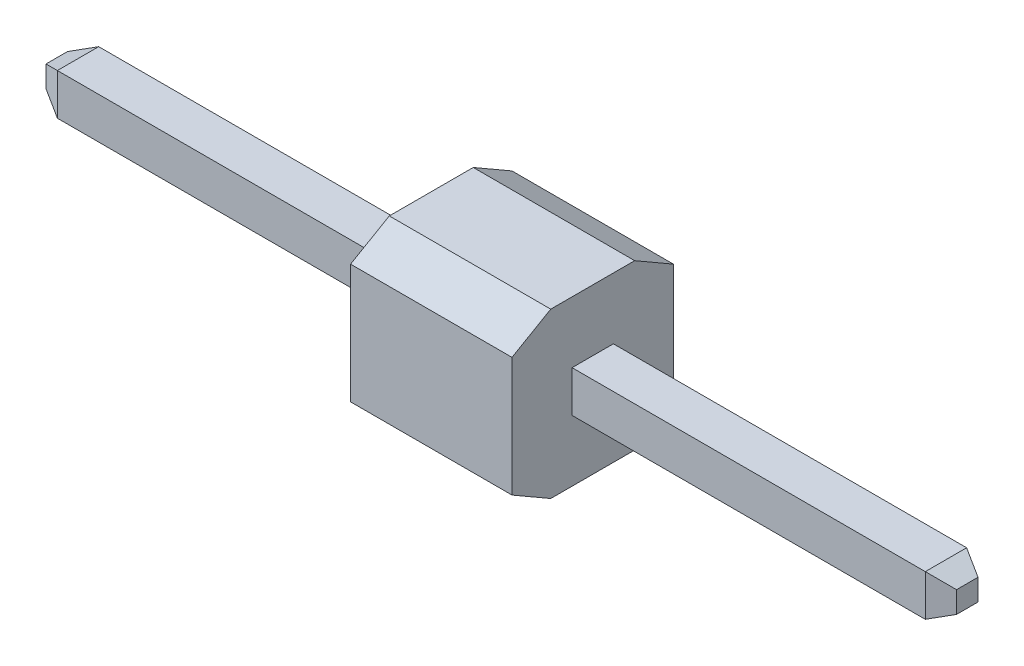
ISO-10303-21;
HEADER;
FILE_DESCRIPTION(('STEP AP214'),'2;1');
FILE_NAME('part.step','',(''),(''),'','','');
FILE_SCHEMA(('AUTOMOTIVE_DESIGN { 1 0 10303 214 1 1 1 1 }'));
ENDSEC;
DATA;
#1=APPLICATION_CONTEXT('core data for automotive mechanical design processes');
#2=APPLICATION_PROTOCOL_DEFINITION('international standard','automotive_design',2000,#1);
#3=PRODUCT_CONTEXT('',#1,'mechanical');
#4=PRODUCT('Part','Part','',(#3));
#5=PRODUCT_RELATED_PRODUCT_CATEGORY('part','',(#4));
#6=PRODUCT_DEFINITION_FORMATION('','',#4);
#7=PRODUCT_DEFINITION_CONTEXT('part definition',#1,'design');
#8=PRODUCT_DEFINITION('design','',#6,#7);
#9=PRODUCT_DEFINITION_SHAPE('','',#8);
#10=(LENGTH_UNIT() NAMED_UNIT(*) SI_UNIT(.MILLI.,.METRE.));
#11=(NAMED_UNIT(*) PLANE_ANGLE_UNIT() SI_UNIT($,.RADIAN.));
#12=(NAMED_UNIT(*) SI_UNIT($,.STERADIAN.) SOLID_ANGLE_UNIT());
#13=UNCERTAINTY_MEASURE_WITH_UNIT(LENGTH_MEASURE(1.E-05),#10,'distance_accuracy_value','');
#14=(GEOMETRIC_REPRESENTATION_CONTEXT(3) GLOBAL_UNCERTAINTY_ASSIGNED_CONTEXT((#13)) GLOBAL_UNIT_ASSIGNED_CONTEXT((#10,
#11,#12)) REPRESENTATION_CONTEXT('',''));
#15=CARTESIAN_POINT('',(0.,0.,0.));
#16=DIRECTION('',(0.,0.,1.));
#17=DIRECTION('',(1.,0.,0.));
#18=AXIS2_PLACEMENT_3D('',#15,#16,#17);
#19=CARTESIAN_POINT('',(5.4210745014383,9.8428784128063,0.629998634255617));
#20=DIRECTION('',(1.,4.37113882867379E-08,-4.37113882867379E-08));
#21=DIRECTION('',(-4.37113882867379E-08,1.,0.));
#22=AXIS2_PLACEMENT_3D('',#19,#20,#21);
#23=PLANE('',#22);
#24=DIRECTION('',(1.59994790123753E-08,0.500000000000192,0.866025403784328));
#25=VECTOR('',#24,1.);
#26=CARTESIAN_POINT('',(5.42107437845239,11.0864682512923,-0.940001365744382));
#27=LINE('',#26,#25);
#28=CARTESIAN_POINT('',(5.42107437845239,11.0864682512923,-0.940001365744382));
#29=VERTEX_POINT('',#28);
#30=CARTESIAN_POINT('',(5.42107438953715,11.4328784128063,-0.340001365744383));
#31=VERTEX_POINT('',#30);
#32=EDGE_CURVE('E11',#29,#31,#27,.T.);
#33=ORIENTED_EDGE('',*,*,#32,.T.);
#34=DIRECTION('',(4.37113886966664E-08,0.,0.999999999999999));
#35=VECTOR('',#34,1.);
#36=CARTESIAN_POINT('',(5.42107438953715,11.4328784128063,-0.340001365744383));
#37=LINE('',#36,#35);
#38=CARTESIAN_POINT('',(5.42107444636195,11.4328784128063,0.959998634255618));
#39=VERTEX_POINT('',#38);
#40=EDGE_CURVE('E304',#31,#39,#37,.T.);
#41=ORIENTED_EDGE('',*,*,#40,.T.);
#42=DIRECTION('',(5.97108656004285E-08,-0.500000000000188,0.866025403784328));
#43=VECTOR('',#42,1.);
#44=CARTESIAN_POINT('',(5.42107444636195,11.4328784128063,0.959998634255618));
#45=LINE('',#44,#43);
#46=CARTESIAN_POINT('',(5.42107448773086,11.0864682512923,1.55999863425562));
#47=VERTEX_POINT('',#46);
#48=EDGE_CURVE('E296',#39,#47,#45,.T.);
#49=ORIENTED_EDGE('',*,*,#48,.T.);
#50=DIRECTION('',(4.37113884815072E-08,-0.999999999999999,0.));
#51=VECTOR('',#50,1.);
#52=CARTESIAN_POINT('',(5.42107448773086,11.0864682512923,1.55999863425562));
#53=LINE('',#52,#51);
#54=CARTESIAN_POINT('',(5.42107456847364,9.2392885743203,1.55999863425562));
#55=VERTEX_POINT('',#54);
#56=EDGE_CURVE('E281',#47,#55,#53,.T.);
#57=ORIENTED_EDGE('',*,*,#56,.T.);
#58=DIRECTION('',(1.59994777304001E-08,0.500000000000192,0.866025403784328));
#59=VECTOR('',#58,1.);
#60=CARTESIAN_POINT('',(5.42107455738888,8.8928784128063,0.959998634255618));
#61=LINE('',#60,#59);
#62=CARTESIAN_POINT('',(5.42107455738888,8.8928784128063,0.959998634255618));
#63=VERTEX_POINT('',#62);
#64=EDGE_CURVE('E265',#63,#55,#61,.T.);
#65=ORIENTED_EDGE('',*,*,#64,.F.);
#66=DIRECTION('',(4.37113886966664E-08,0.,0.999999999999999));
#67=VECTOR('',#66,1.);
#68=CARTESIAN_POINT('',(5.42107450056408,8.8928784128063,-0.340001365744383));
#69=LINE('',#68,#67);
#70=CARTESIAN_POINT('',(5.42107450056408,8.8928784128063,-0.340001365744383));
#71=VERTEX_POINT('',#70);
#72=EDGE_CURVE('E248',#71,#63,#69,.T.);
#73=ORIENTED_EDGE('',*,*,#72,.F.);
#74=DIRECTION('',(5.97108668824036E-08,-0.500000000000188,0.866025403784328));
#75=VECTOR('',#74,1.);
#76=CARTESIAN_POINT('',(5.42107445919517,9.2392885743203,-0.940001365744382));
#77=LINE('',#76,#75);
#78=CARTESIAN_POINT('',(5.42107445919517,9.2392885743203,-0.940001365744382));
#79=VERTEX_POINT('',#78);
#80=EDGE_CURVE('E242',#79,#71,#77,.T.);
#81=ORIENTED_EDGE('',*,*,#80,.F.);
#82=DIRECTION('',(4.37113884815072E-08,-0.999999999999999,0.));
#83=VECTOR('',#82,1.);
#84=CARTESIAN_POINT('',(5.42107437845239,11.0864682512923,-0.940001365744382));
#85=LINE('',#84,#83);
#86=EDGE_CURVE('E236',#29,#79,#85,.T.);
#87=ORIENTED_EDGE('',*,*,#86,.F.);
#88=EDGE_LOOP('',(#33,#41,#49,#57,#65,#73,#81,#87));
#89=FACE_BOUND('',#88,.T.);
#90=DIRECTION('',(-4.37113886753159E-08,0.,-0.999999999999999));
#91=VECTOR('',#90,1.);
#92=CARTESIAN_POINT('',(5.42107447346302,10.4828784128063,0.629998634255617));
#93=LINE('',#92,#91);
#94=CARTESIAN_POINT('',(5.42107447346302,10.4828784128063,0.629998634255617));
#95=VERTEX_POINT('',#94);
#96=CARTESIAN_POINT('',(5.42107444548773,10.4828784128063,-0.0100013657443826));
#97=VERTEX_POINT('',#96);
#98=EDGE_CURVE('E302',#95,#97,#93,.T.);
#99=ORIENTED_EDGE('',*,*,#98,.T.);
#100=DIRECTION('',(-4.3711388675316E-08,0.999999999999999,0.));
#101=VECTOR('',#100,1.);
#102=CARTESIAN_POINT('',(5.42107447346302,9.8428784128063,-0.0100013657443826));
#103=LINE('',#102,#101);
#104=CARTESIAN_POINT('',(5.42107447346302,9.8428784128063,-0.0100013657443826));
#105=VERTEX_POINT('',#104);
#106=EDGE_CURVE('E293',#105,#97,#103,.T.);
#107=ORIENTED_EDGE('',*,*,#106,.F.);
#108=DIRECTION('',(-4.37113886753159E-08,0.,-0.999999999999999));
#109=VECTOR('',#108,1.);
#110=CARTESIAN_POINT('',(5.4210745014383,9.8428784128063,0.629998634255617));
#111=LINE('',#110,#109);
#112=CARTESIAN_POINT('',(5.4210745014383,9.8428784128063,0.629998634255617));
#113=VERTEX_POINT('',#112);
#114=EDGE_CURVE('E278',#113,#105,#111,.T.);
#115=ORIENTED_EDGE('',*,*,#114,.F.);
#116=DIRECTION('',(-4.3711388675316E-08,0.999999999999999,0.));
#117=VECTOR('',#116,1.);
#118=CARTESIAN_POINT('',(5.4210745014383,9.8428784128063,0.629998634255617));
#119=LINE('',#118,#117);
#120=EDGE_CURVE('E263',#113,#95,#119,.T.);
#121=ORIENTED_EDGE('',*,*,#120,.T.);
#122=EDGE_LOOP('',(#99,#107,#115,#121));
#123=FACE_BOUND('',#122,.T.);
#124=ADVANCED_FACE('F17',(#89,#123),#23,.T.);
#125=CARTESIAN_POINT('',(2.9210745014383,9.84287830352783,0.629998743534088));
#126=DIRECTION('',(1.,4.37113882867379E-08,-4.37113882867379E-08));
#127=DIRECTION('',(-4.37113882867379E-08,1.,0.));
#128=AXIS2_PLACEMENT_3D('',#125,#126,#127);
#129=PLANE('',#128);
#130=DIRECTION('',(1.59994783713877E-08,0.500000000000192,0.866025403784328));
#131=VECTOR('',#130,1.);
#132=CARTESIAN_POINT('',(2.92107437845239,11.0864681420138,-0.940001256465912));
#133=LINE('',#132,#131);
#134=CARTESIAN_POINT('',(2.92107437845239,11.0864681420138,-0.940001256465912));
#135=VERTEX_POINT('',#134);
#136=CARTESIAN_POINT('',(2.92107438953715,11.4328783035278,-0.340001256465912));
#137=VERTEX_POINT('',#136);
#138=EDGE_CURVE('E24',#135,#137,#133,.T.);
#139=ORIENTED_EDGE('',*,*,#138,.F.);
#140=DIRECTION('',(4.37113882410924E-08,-0.999999999999999,0.));
#141=VECTOR('',#140,1.);
#142=CARTESIAN_POINT('',(2.92107437845239,11.0864681420138,-0.940001256465912));
#143=LINE('',#142,#141);
#144=CARTESIAN_POINT('',(2.92107445919517,9.23928846504183,-0.940001256465912));
#145=VERTEX_POINT('',#144);
#146=EDGE_CURVE('E300',#135,#145,#143,.T.);
#147=ORIENTED_EDGE('',*,*,#146,.T.);
#148=DIRECTION('',(5.97108668824036E-08,-0.500000000000188,0.866025403784328));
#149=VECTOR('',#148,1.);
#150=CARTESIAN_POINT('',(2.92107445919517,9.23928846504183,-0.940001256465912));
#151=LINE('',#150,#149);
#152=CARTESIAN_POINT('',(2.92107450056408,8.89287830352783,-0.340001256465912));
#153=VERTEX_POINT('',#152);
#154=EDGE_CURVE('E286',#145,#153,#151,.T.);
#155=ORIENTED_EDGE('',*,*,#154,.T.);
#156=DIRECTION('',(4.37113883550593E-08,0.,0.999999999999999));
#157=VECTOR('',#156,1.);
#158=CARTESIAN_POINT('',(2.92107450056408,8.89287830352783,-0.340001256465912));
#159=LINE('',#158,#157);
#160=CARTESIAN_POINT('',(2.92107455738888,8.89287830352783,0.959998743534088));
#161=VERTEX_POINT('',#160);
#162=EDGE_CURVE('E271',#153,#161,#159,.T.);
#163=ORIENTED_EDGE('',*,*,#162,.T.);
#164=DIRECTION('',(1.59994783713877E-08,0.500000000000192,0.866025403784328));
#165=VECTOR('',#164,1.);
#166=CARTESIAN_POINT('',(2.92107455738888,8.89287830352783,0.959998743534088));
#167=LINE('',#166,#165);
#168=CARTESIAN_POINT('',(2.92107456847364,9.23928846504183,1.55999874353409));
#169=VERTEX_POINT('',#168);
#170=EDGE_CURVE('E253',#161,#169,#167,.T.);
#171=ORIENTED_EDGE('',*,*,#170,.T.);
#172=DIRECTION('',(4.37113882410924E-08,-0.999999999999999,0.));
#173=VECTOR('',#172,1.);
#174=CARTESIAN_POINT('',(2.92107448773086,11.0864681420138,1.55999874353409));
#175=LINE('',#174,#173);
#176=CARTESIAN_POINT('',(2.92107448773086,11.0864681420138,1.55999874353409));
#177=VERTEX_POINT('',#176);
#178=EDGE_CURVE('E261',#177,#169,#175,.T.);
#179=ORIENTED_EDGE('',*,*,#178,.F.);
#180=DIRECTION('',(5.97108668824036E-08,-0.500000000000188,0.866025403784328));
#181=VECTOR('',#180,1.);
#182=CARTESIAN_POINT('',(2.92107444636195,11.4328783035278,0.959998743534088));
#183=LINE('',#182,#181);
#184=CARTESIAN_POINT('',(2.92107444636195,11.4328783035278,0.959998743534088));
#185=VERTEX_POINT('',#184);
#186=EDGE_CURVE('E276',#185,#177,#183,.T.);
#187=ORIENTED_EDGE('',*,*,#186,.F.);
#188=DIRECTION('',(4.37113883550593E-08,0.,0.999999999999999));
#189=VECTOR('',#188,1.);
#190=CARTESIAN_POINT('',(2.92107438953715,11.4328783035278,-0.340001256465912));
#191=LINE('',#190,#189);
#192=EDGE_CURVE('E291',#137,#185,#191,.T.);
#193=ORIENTED_EDGE('',*,*,#192,.F.);
#194=EDGE_LOOP('',(#139,#147,#155,#163,#171,#179,#187,#193));
#195=FACE_BOUND('',#194,.T.);
#196=DIRECTION('',(-4.37113879814266E-08,0.999999999999999,0.));
#197=VECTOR('',#196,1.);
#198=CARTESIAN_POINT('',(2.92107447346301,9.84287830352783,-0.0100012564659119));
#199=LINE('',#198,#197);
#200=CARTESIAN_POINT('',(2.92107447346301,9.84287830352783,-0.0100012564659119));
#201=VERTEX_POINT('',#200);
#202=CARTESIAN_POINT('',(2.92107444548773,10.4828783035278,-0.0100012564659119));
#203=VERTEX_POINT('',#202);
#204=EDGE_CURVE('E298',#201,#203,#199,.T.);
#205=ORIENTED_EDGE('',*,*,#204,.T.);
#206=DIRECTION('',(-4.37113879814266E-08,0.,-0.999999999999999));
#207=VECTOR('',#206,1.);
#208=CARTESIAN_POINT('',(2.92107447346301,10.4828783035278,0.629998743534088));
#209=LINE('',#208,#207);
#210=CARTESIAN_POINT('',(2.92107447346301,10.4828783035278,0.629998743534088));
#211=VERTEX_POINT('',#210);
#212=EDGE_CURVE('E283',#211,#203,#209,.T.);
#213=ORIENTED_EDGE('',*,*,#212,.F.);
#214=DIRECTION('',(-4.3711388675316E-08,0.999999999999999,0.));
#215=VECTOR('',#214,1.);
#216=CARTESIAN_POINT('',(2.9210745014383,9.84287830352783,0.629998743534088));
#217=LINE('',#216,#215);
#218=CARTESIAN_POINT('',(2.9210745014383,9.84287830352783,0.629998743534088));
#219=VERTEX_POINT('',#218);
#220=EDGE_CURVE('E268',#219,#211,#217,.T.);
#221=ORIENTED_EDGE('',*,*,#220,.F.);
#222=DIRECTION('',(-4.37113886753159E-08,0.,-0.999999999999999));
#223=VECTOR('',#222,1.);
#224=CARTESIAN_POINT('',(2.9210745014383,9.84287830352783,0.629998743534088));
#225=LINE('',#224,#223);
#226=EDGE_CURVE('E251',#219,#201,#225,.T.);
#227=ORIENTED_EDGE('',*,*,#226,.T.);
#228=EDGE_LOOP('',(#205,#213,#221,#227));
#229=FACE_BOUND('',#228,.T.);
#230=ADVANCED_FACE('F314',(#195,#229),#129,.F.);
#231=CARTESIAN_POINT('',(5.42107437845239,11.0864682512923,-0.940001365744382));
#232=DIRECTION('',(5.97108668343731E-08,-0.866025403784328,0.50000000000019));
#233=DIRECTION('',(-1.59994785476185E-08,-0.500000000000192,-0.866025403784329));
#234=AXIS2_PLACEMENT_3D('',#231,#232,#233);
#235=PLANE('',#234);
#236=ORIENTED_EDGE('',*,*,#138,.T.);
#237=DIRECTION('',(-0.999999999999998,-4.37113889972806E-08,4.37113883755557E-08));
#238=VECTOR('',#237,1.);
#239=CARTESIAN_POINT('',(5.42107438953715,11.4328784128063,-0.340001365744383));
#240=LINE('',#239,#238);
#241=EDGE_CURVE('E288',#31,#137,#240,.T.);
#242=ORIENTED_EDGE('',*,*,#241,.F.);
#243=ORIENTED_EDGE('',*,*,#32,.F.);
#244=DIRECTION('',(-0.999999999999998,-4.37113882867378E-08,4.37113881091022E-08));
#245=VECTOR('',#244,1.);
#246=CARTESIAN_POINT('',(5.42107437845239,11.0864682512923,-0.940001365744382));
#247=LINE('',#246,#245);
#248=EDGE_CURVE('E256',#29,#135,#247,.T.);
#249=ORIENTED_EDGE('',*,*,#248,.T.);
#250=EDGE_LOOP('',(#236,#242,#243,#249));
#251=FACE_BOUND('',#250,.T.);
#252=ADVANCED_FACE('F306',(#251),#235,.F.);
#253=CARTESIAN_POINT('',(5.42107438953715,11.4328784128063,-0.340001365744383));
#254=DIRECTION('',(4.37113882867379E-08,-1.,0.));
#255=DIRECTION('',(1.,4.37113882867379E-08,-4.37113882867379E-08));
#256=AXIS2_PLACEMENT_3D('',#253,#254,#255);
#257=PLANE('',#256);
#258=ORIENTED_EDGE('',*,*,#192,.T.);
#259=DIRECTION('',(-0.999999999999998,-4.37113882867378E-08,4.37113882867378E-08));
#260=VECTOR('',#259,1.);
#261=CARTESIAN_POINT('',(5.42107444636195,11.4328784128063,0.959998634255618));
#262=LINE('',#261,#260);
#263=EDGE_CURVE('E273',#39,#185,#262,.T.);
#264=ORIENTED_EDGE('',*,*,#263,.F.);
#265=ORIENTED_EDGE('',*,*,#40,.F.);
#266=ORIENTED_EDGE('',*,*,#241,.T.);
#267=EDGE_LOOP('',(#258,#264,#265,#266));
#268=FACE_BOUND('',#267,.T.);
#269=ADVANCED_FACE('F311',(#268),#257,.F.);
#270=CARTESIAN_POINT('',(5.42107444636195,11.4328784128063,0.959998634255618));
#271=DIRECTION('',(1.59994785476185E-08,-0.86602540378433,-0.50000000000019));
#272=DIRECTION('',(-5.97108668343731E-08,0.500000000000188,-0.866025403784329));
#273=AXIS2_PLACEMENT_3D('',#270,#271,#272);
#274=PLANE('',#273);
#275=ORIENTED_EDGE('',*,*,#186,.T.);
#276=DIRECTION('',(-0.999999999999998,-4.37113882867378E-08,4.37113882867378E-08));
#277=VECTOR('',#276,1.);
#278=CARTESIAN_POINT('',(5.42107448773086,11.0864682512923,1.55999863425562));
#279=LINE('',#278,#277);
#280=EDGE_CURVE('E258',#47,#177,#279,.T.);
#281=ORIENTED_EDGE('',*,*,#280,.F.);
#282=ORIENTED_EDGE('',*,*,#48,.F.);
#283=ORIENTED_EDGE('',*,*,#263,.T.);
#284=EDGE_LOOP('',(#275,#281,#282,#283));
#285=FACE_BOUND('',#284,.T.);
#286=ADVANCED_FACE('F319',(#285),#274,.F.);
#287=CARTESIAN_POINT('',(5.42107448773086,11.0864682512923,1.55999863425562));
#288=DIRECTION('',(-4.37113882867379E-08,0.,-1.));
#289=DIRECTION('',(-1.,-4.37113882867379E-08,4.37113882867379E-08));
#290=AXIS2_PLACEMENT_3D('',#287,#288,#289);
#291=PLANE('',#290);
#292=ORIENTED_EDGE('',*,*,#178,.T.);
#293=DIRECTION('',(-0.999999999999998,-4.37113889972806E-08,4.37113882867378E-08));
#294=VECTOR('',#293,1.);
#295=CARTESIAN_POINT('',(5.42107456847364,9.2392885743203,1.55999863425562));
#296=LINE('',#295,#294);
#297=EDGE_CURVE('E245',#55,#169,#296,.T.);
#298=ORIENTED_EDGE('',*,*,#297,.F.);
#299=ORIENTED_EDGE('',*,*,#56,.F.);
#300=ORIENTED_EDGE('',*,*,#280,.T.);
#301=EDGE_LOOP('',(#292,#298,#299,#300));
#302=FACE_BOUND('',#301,.T.);
#303=ADVANCED_FACE('F326',(#302),#291,.F.);
#304=CARTESIAN_POINT('',(5.42107455738888,8.8928784128063,0.959998634255618));
#305=DIRECTION('',(5.97108668343731E-08,-0.866025403784328,0.50000000000019));
#306=DIRECTION('',(-1.59994785476185E-08,-0.500000000000192,-0.866025403784329));
#307=AXIS2_PLACEMENT_3D('',#304,#305,#306);
#308=PLANE('',#307);
#309=ORIENTED_EDGE('',*,*,#170,.F.);
#310=DIRECTION('',(-0.999999999999998,-4.37113882867378E-08,4.37113882867378E-08));
#311=VECTOR('',#310,1.);
#312=CARTESIAN_POINT('',(5.42107455738888,8.8928784128063,0.959998634255618));
#313=LINE('',#312,#311);
#314=EDGE_CURVE('E239',#63,#161,#313,.T.);
#315=ORIENTED_EDGE('',*,*,#314,.F.);
#316=ORIENTED_EDGE('',*,*,#64,.T.);
#317=ORIENTED_EDGE('',*,*,#297,.T.);
#318=EDGE_LOOP('',(#309,#315,#316,#317));
#319=FACE_BOUND('',#318,.T.);
#320=ADVANCED_FACE('F329',(#319),#308,.T.);
#321=CARTESIAN_POINT('',(5.42107450056408,8.8928784128063,-0.340001365744383));
#322=DIRECTION('',(4.37113882867379E-08,-1.,0.));
#323=DIRECTION('',(1.,4.37113882867379E-08,-4.37113882867379E-08));
#324=AXIS2_PLACEMENT_3D('',#321,#322,#323);
#325=PLANE('',#324);
#326=ORIENTED_EDGE('',*,*,#162,.F.);
#327=DIRECTION('',(-0.999999999999998,-4.37113882867378E-08,4.37113883755557E-08));
#328=VECTOR('',#327,1.);
#329=CARTESIAN_POINT('',(5.42107450056408,8.8928784128063,-0.340001365744383));
#330=LINE('',#329,#328);
#331=EDGE_CURVE('E233',#71,#153,#330,.T.);
#332=ORIENTED_EDGE('',*,*,#331,.F.);
#333=ORIENTED_EDGE('',*,*,#72,.T.);
#334=ORIENTED_EDGE('',*,*,#314,.T.);
#335=EDGE_LOOP('',(#326,#332,#333,#334));
#336=FACE_BOUND('',#335,.T.);
#337=ADVANCED_FACE('F333',(#336),#325,.T.);
#338=CARTESIAN_POINT('',(5.42107445919517,9.2392885743203,-0.940001365744382));
#339=DIRECTION('',(1.59994785476185E-08,-0.86602540378433,-0.50000000000019));
#340=DIRECTION('',(-5.97108668343731E-08,0.500000000000188,-0.866025403784329));
#341=AXIS2_PLACEMENT_3D('',#338,#339,#340);
#342=PLANE('',#341);
#343=ORIENTED_EDGE('',*,*,#154,.F.);
#344=DIRECTION('',(-0.999999999999998,-4.37113889972806E-08,4.37113881091022E-08));
#345=VECTOR('',#344,1.);
#346=CARTESIAN_POINT('',(5.42107445919517,9.2392885743203,-0.940001365744382));
#347=LINE('',#346,#345);
#348=EDGE_CURVE('E230',#79,#145,#347,.T.);
#349=ORIENTED_EDGE('',*,*,#348,.F.);
#350=ORIENTED_EDGE('',*,*,#80,.T.);
#351=ORIENTED_EDGE('',*,*,#331,.T.);
#352=EDGE_LOOP('',(#343,#349,#350,#351));
#353=FACE_BOUND('',#352,.T.);
#354=ADVANCED_FACE('F337',(#353),#342,.T.);
#355=CARTESIAN_POINT('',(5.42107437845239,11.0864682512923,-0.940001365744382));
#356=DIRECTION('',(-4.37113882867379E-08,0.,-1.));
#357=DIRECTION('',(-4.37113882867379E-08,1.,0.));
#358=AXIS2_PLACEMENT_3D('',#355,#356,#357);
#359=PLANE('',#358);
#360=ORIENTED_EDGE('',*,*,#146,.F.);
#361=ORIENTED_EDGE('',*,*,#248,.F.);
#362=ORIENTED_EDGE('',*,*,#86,.T.);
#363=ORIENTED_EDGE('',*,*,#348,.T.);
#364=EDGE_LOOP('',(#360,#361,#362,#363));
#365=FACE_BOUND('',#364,.T.);
#366=ADVANCED_FACE('F339',(#365),#359,.T.);
#367=CARTESIAN_POINT('',(-2.8789254985617,9.84287805000178,0.62999899706014));
#368=DIRECTION('',(-1.,-4.37113882867379E-08,4.37113882867379E-08));
#369=DIRECTION('',(4.37113882867379E-08,-1.,0.));
#370=AXIS2_PLACEMENT_3D('',#367,#368,#369);
#371=PLANE('',#370);
#372=DIRECTION('',(4.37113874013716E-08,-0.999999999999999,0.));
#373=VECTOR('',#372,1.);
#374=CARTESIAN_POINT('',(-2.87892554105952,10.3289965228108,0.14388052425114));
#375=LINE('',#374,#373);
#376=CARTESIAN_POINT('',(-2.87892554105952,10.3289965228108,0.14388052425114));
#377=VERTEX_POINT('',#376);
#378=CARTESIAN_POINT('',(-2.87892552653699,9.99675957719278,0.14388052425114));
#379=VERTEX_POINT('',#378);
#380=EDGE_CURVE('E228',#377,#379,#375,.T.);
#381=ORIENTED_EDGE('',*,*,#380,.T.);
#382=DIRECTION('',(4.37113900746999E-08,0.,0.999999999999999));
#383=VECTOR('',#382,1.);
#384=CARTESIAN_POINT('',(-2.87892552653699,9.99675957719278,0.14388052425114));
#385=LINE('',#384,#383);
#386=CARTESIAN_POINT('',(-2.87892551201445,9.99675957719278,0.47611746986914));
#387=VERTEX_POINT('',#386);
#388=EDGE_CURVE('E223',#379,#387,#385,.T.);
#389=ORIENTED_EDGE('',*,*,#388,.T.);
#390=DIRECTION('',(-4.37113900746999E-08,0.999999999999999,0.));
#391=VECTOR('',#390,1.);
#392=CARTESIAN_POINT('',(-2.87892551201445,9.99675957719278,0.47611746986914));
#393=LINE('',#392,#391);
#394=CARTESIAN_POINT('',(-2.87892552653699,10.3289965228108,0.47611746986914));
#395=VERTEX_POINT('',#394);
#396=EDGE_CURVE('E215',#387,#395,#393,.T.);
#397=ORIENTED_EDGE('',*,*,#396,.T.);
#398=DIRECTION('',(-4.37113820547151E-08,0.,-0.999999999999999));
#399=VECTOR('',#398,1.);
#400=CARTESIAN_POINT('',(-2.87892552653699,10.3289965228108,0.47611746986914));
#401=LINE('',#400,#399);
#402=EDGE_CURVE('E207',#395,#377,#401,.T.);
#403=ORIENTED_EDGE('',*,*,#402,.T.);
#404=EDGE_LOOP('',(#381,#389,#397,#403));
#405=FACE_BOUND('',#404,.T.);
#406=ADVANCED_FACE('F341',(#405),#371,.T.);
#407=CARTESIAN_POINT('',(-2.8789254985617,9.84287805000178,0.62999899706014));
#408=DIRECTION('',(4.37113882867379E-08,-1.,0.));
#409=DIRECTION('',(-4.37113882867379E-08,0.,-1.));
#410=AXIS2_PLACEMENT_3D('',#407,#408,#409);
#411=PLANE('',#410);
#412=DIRECTION('',(0.999999999999998,4.37113885205545E-08,-4.37113882769955E-08));
#413=VECTOR('',#412,1.);
#414=CARTESIAN_POINT('',(-2.5489254985617,9.84287806442654,0.629998982635382));
#415=LINE('',#414,#413);
#416=CARTESIAN_POINT('',(-2.5489254985617,9.84287806442654,0.629998982635382));
#417=VERTEX_POINT('',#416);
#418=EDGE_CURVE('E225',#417,#219,#415,.T.);
#419=ORIENTED_EDGE('',*,*,#418,.F.);
#420=DIRECTION('',(-4.37113886753159E-08,0.,-0.999999999999999));
#421=VECTOR('',#420,1.);
#422=CARTESIAN_POINT('',(-2.5489254985617,9.84287806442654,0.629998982635382));
#423=LINE('',#422,#421);
#424=CARTESIAN_POINT('',(-2.54892552653699,9.84287806442654,-0.010001017364618));
#425=VERTEX_POINT('',#424);
#426=EDGE_CURVE('E217',#417,#425,#423,.T.);
#427=ORIENTED_EDGE('',*,*,#426,.T.);
#428=DIRECTION('',(0.999999999999998,4.37113885205545E-08,-4.37113882161057E-08));
#429=VECTOR('',#428,1.);
#430=CARTESIAN_POINT('',(-2.54892552653699,9.84287806442654,-0.010001017364618));
#431=LINE('',#430,#429);
#432=EDGE_CURVE('E220',#425,#201,#431,.T.);
#433=ORIENTED_EDGE('',*,*,#432,.T.);
#434=ORIENTED_EDGE('',*,*,#226,.F.);
#435=EDGE_LOOP('',(#419,#427,#433,#434));
#436=FACE_BOUND('',#435,.T.);
#437=ADVANCED_FACE('F348',(#436),#411,.T.);
#438=CARTESIAN_POINT('',(-2.87892552653699,9.84287805000178,-0.0100010029398598));
#439=DIRECTION('',(-4.37113882867379E-08,0.,-1.));
#440=DIRECTION('',(-1.,-4.37113882867379E-08,4.37113882867379E-08));
#441=AXIS2_PLACEMENT_3D('',#438,#439,#440);
#442=PLANE('',#441);
#443=ORIENTED_EDGE('',*,*,#432,.F.);
#444=DIRECTION('',(-4.37113886753159E-08,0.999999999999999,0.));
#445=VECTOR('',#444,1.);
#446=CARTESIAN_POINT('',(-2.54892552653699,9.84287806442654,-0.010001017364618));
#447=LINE('',#446,#445);
#448=CARTESIAN_POINT('',(-2.54892555451227,10.4828780644265,-0.010001017364618));
#449=VERTEX_POINT('',#448);
#450=EDGE_CURVE('E209',#425,#449,#447,.T.);
#451=ORIENTED_EDGE('',*,*,#450,.T.);
#452=DIRECTION('',(0.999999999999998,4.37113881958092E-08,-4.37113882161057E-08));
#453=VECTOR('',#452,1.);
#454=CARTESIAN_POINT('',(-2.54892555451227,10.4828780644265,-0.010001017364618));
#455=LINE('',#454,#453);
#456=EDGE_CURVE('E212',#449,#203,#455,.T.);
#457=ORIENTED_EDGE('',*,*,#456,.T.);
#458=ORIENTED_EDGE('',*,*,#204,.F.);
#459=EDGE_LOOP('',(#443,#451,#457,#458));
#460=FACE_BOUND('',#459,.T.);
#461=ADVANCED_FACE('F424',(#460),#442,.T.);
#462=CARTESIAN_POINT('',(-2.87892552653699,10.4828780500018,0.62999899706014));
#463=DIRECTION('',(4.37113882867379E-08,-1.,0.));
#464=DIRECTION('',(-4.37113882867379E-08,0.,-1.));
#465=AXIS2_PLACEMENT_3D('',#462,#463,#464);
#466=PLANE('',#465);
#467=ORIENTED_EDGE('',*,*,#456,.F.);
#468=DIRECTION('',(4.37113900630947E-08,0.,0.999999999999999));
#469=VECTOR('',#468,1.);
#470=CARTESIAN_POINT('',(-2.54892555451228,10.4828780644265,-0.010001017364618));
#471=LINE('',#470,#469);
#472=CARTESIAN_POINT('',(-2.54892552653699,10.4828780644265,0.629998982635382));
#473=VERTEX_POINT('',#472);
#474=EDGE_CURVE('E201',#449,#473,#471,.T.);
#475=ORIENTED_EDGE('',*,*,#474,.T.);
#476=DIRECTION('',(0.999999999999998,4.37113881958092E-08,-4.37113882769955E-08));
#477=VECTOR('',#476,1.);
#478=CARTESIAN_POINT('',(-2.54892552653699,10.4828780644265,0.629998982635382));
#479=LINE('',#478,#477);
#480=EDGE_CURVE('E204',#473,#211,#479,.T.);
#481=ORIENTED_EDGE('',*,*,#480,.T.);
#482=ORIENTED_EDGE('',*,*,#212,.T.);
#483=EDGE_LOOP('',(#467,#475,#481,#482));
#484=FACE_BOUND('',#483,.T.);
#485=ADVANCED_FACE('F421',(#484),#466,.F.);
#486=CARTESIAN_POINT('',(-2.8789254985617,9.84287805000178,0.62999899706014));
#487=DIRECTION('',(-4.37113882867379E-08,0.,-1.));
#488=DIRECTION('',(-1.,-4.37113882867379E-08,4.37113882867379E-08));
#489=AXIS2_PLACEMENT_3D('',#486,#487,#488);
#490=PLANE('',#489);
#491=ORIENTED_EDGE('',*,*,#480,.F.);
#492=DIRECTION('',(4.37113900630947E-08,-0.999999999999999,0.));
#493=VECTOR('',#492,1.);
#494=CARTESIAN_POINT('',(-2.54892552653699,10.4828780644265,0.629998982635382));
#495=LINE('',#494,#493);
#496=EDGE_CURVE('E196',#473,#417,#495,.T.);
#497=ORIENTED_EDGE('',*,*,#496,.T.);
#498=ORIENTED_EDGE('',*,*,#418,.T.);
#499=ORIENTED_EDGE('',*,*,#220,.T.);
#500=EDGE_LOOP('',(#491,#497,#498,#499));
#501=FACE_BOUND('',#500,.T.);
#502=ADVANCED_FACE('F376',(#501),#490,.F.);
#503=CARTESIAN_POINT('',(-2.8789254985617,9.84287805000178,0.62999899706014));
#504=DIRECTION('',(-4.37113882867379E-08,0.,-1.));
#505=DIRECTION('',(-1.,-4.37113882867379E-08,4.37113882867379E-08));
#506=AXIS2_PLACEMENT_3D('',#503,#504,#505);
#507=PLANE('',#506);
#508=DIRECTION('',(0.999999999999998,4.37113881958092E-08,-4.37113882769955E-08));
#509=VECTOR('',#508,1.);
#510=CARTESIAN_POINT('',(5.4210745014383,9.8428784128063,0.629998634255617));
#511=LINE('',#510,#509);
#512=CARTESIAN_POINT('',(10.8910745014383,9.8428786519076,0.629998395154324));
#513=VERTEX_POINT('',#512);
#514=EDGE_CURVE('E199',#113,#513,#511,.T.);
#515=ORIENTED_EDGE('',*,*,#514,.T.);
#516=DIRECTION('',(-4.37113900630947E-08,0.999999999999999,0.));
#517=VECTOR('',#516,1.);
#518=CARTESIAN_POINT('',(10.8910745014383,9.8428786519076,0.629998395154324));
#519=LINE('',#518,#517);
#520=CARTESIAN_POINT('',(10.891074473463,10.4828786519076,0.629998395154324));
#521=VERTEX_POINT('',#520);
#522=EDGE_CURVE('E191',#513,#521,#519,.T.);
#523=ORIENTED_EDGE('',*,*,#522,.T.);
#524=DIRECTION('',(0.999999999999998,4.37113885205545E-08,-4.37113882769955E-08));
#525=VECTOR('',#524,1.);
#526=CARTESIAN_POINT('',(5.42107447346302,10.4828784128063,0.629998634255617));
#527=LINE('',#526,#525);
#528=EDGE_CURVE('E194',#95,#521,#527,.T.);
#529=ORIENTED_EDGE('',*,*,#528,.F.);
#530=ORIENTED_EDGE('',*,*,#120,.F.);
#531=EDGE_LOOP('',(#515,#523,#529,#530));
#532=FACE_BOUND('',#531,.T.);
#533=ADVANCED_FACE('F367',(#532),#507,.F.);
#534=CARTESIAN_POINT('',(-2.87892552653699,10.4828780500018,0.62999899706014));
#535=DIRECTION('',(4.37113882867379E-08,-1.,0.));
#536=DIRECTION('',(-4.37113882867379E-08,0.,-1.));
#537=AXIS2_PLACEMENT_3D('',#534,#535,#536);
#538=PLANE('',#537);
#539=ORIENTED_EDGE('',*,*,#528,.T.);
#540=DIRECTION('',(-4.37113900630947E-08,0.,-0.999999999999999));
#541=VECTOR('',#540,1.);
#542=CARTESIAN_POINT('',(10.891074473463,10.4828786519076,0.629998395154324));
#543=LINE('',#542,#541);
#544=CARTESIAN_POINT('',(10.8910744454877,10.4828786519076,-0.0100016048456765));
#545=VERTEX_POINT('',#544);
#546=EDGE_CURVE('E186',#521,#545,#543,.T.);
#547=ORIENTED_EDGE('',*,*,#546,.T.);
#548=DIRECTION('',(0.999999999999998,4.37113888452998E-08,-4.37113881146228E-08));
#549=VECTOR('',#548,1.);
#550=CARTESIAN_POINT('',(5.42107444548773,10.4828784128063,-0.0100013657443823));
#551=LINE('',#550,#549);
#552=EDGE_CURVE('E189',#97,#545,#551,.T.);
#553=ORIENTED_EDGE('',*,*,#552,.F.);
#554=ORIENTED_EDGE('',*,*,#98,.F.);
#555=EDGE_LOOP('',(#539,#547,#553,#554));
#556=FACE_BOUND('',#555,.T.);
#557=ADVANCED_FACE('F364',(#556),#538,.F.);
#558=CARTESIAN_POINT('',(-2.87892552653699,9.84287805000178,-0.0100010029398598));
#559=DIRECTION('',(-4.37113882867379E-08,0.,-1.));
#560=DIRECTION('',(-1.,-4.37113882867379E-08,4.37113882867379E-08));
#561=AXIS2_PLACEMENT_3D('',#558,#559,#560);
#562=PLANE('',#561);
#563=ORIENTED_EDGE('',*,*,#552,.T.);
#564=DIRECTION('',(4.37113900630947E-08,-0.999999999999999,0.));
#565=VECTOR('',#564,1.);
#566=CARTESIAN_POINT('',(10.8910744454877,10.4828786519076,-0.0100016048456765));
#567=LINE('',#566,#565);
#568=CARTESIAN_POINT('',(10.891074473463,9.84287865190759,-0.0100016048456765));
#569=VERTEX_POINT('',#568);
#570=EDGE_CURVE('E176',#545,#569,#567,.T.);
#571=ORIENTED_EDGE('',*,*,#570,.T.);
#572=DIRECTION('',(0.999999999999998,4.37113885205545E-08,-4.37113881146228E-08));
#573=VECTOR('',#572,1.);
#574=CARTESIAN_POINT('',(5.42107447346302,9.8428784128063,-0.0100013657443823));
#575=LINE('',#574,#573);
#576=EDGE_CURVE('E179',#105,#569,#575,.T.);
#577=ORIENTED_EDGE('',*,*,#576,.F.);
#578=ORIENTED_EDGE('',*,*,#106,.T.);
#579=EDGE_LOOP('',(#563,#571,#577,#578));
#580=FACE_BOUND('',#579,.T.);
#581=ADVANCED_FACE('F366',(#580),#562,.T.);
#582=CARTESIAN_POINT('',(-2.8789254985617,9.84287805000178,0.62999899706014));
#583=DIRECTION('',(4.37113882867379E-08,-1.,0.));
#584=DIRECTION('',(-4.37113882867379E-08,0.,-1.));
#585=AXIS2_PLACEMENT_3D('',#582,#583,#584);
#586=PLANE('',#585);
#587=ORIENTED_EDGE('',*,*,#576,.T.);
#588=DIRECTION('',(4.37113900630947E-08,0.,0.999999999999999));
#589=VECTOR('',#588,1.);
#590=CARTESIAN_POINT('',(10.891074473463,9.84287865190759,-0.0100016048456765));
#591=LINE('',#590,#589);
#592=EDGE_CURVE('E167',#569,#513,#591,.T.);
#593=ORIENTED_EDGE('',*,*,#592,.T.);
#594=ORIENTED_EDGE('',*,*,#514,.F.);
#595=ORIENTED_EDGE('',*,*,#114,.T.);
#596=EDGE_LOOP('',(#587,#593,#594,#595));
#597=FACE_BOUND('',#596,.T.);
#598=ADVANCED_FACE('F373',(#597),#586,.T.);
#599=CARTESIAN_POINT('',(11.2210745014383,9.84287866633235,0.629998380729565));
#600=DIRECTION('',(-1.,-4.37113882867379E-08,4.37113882867379E-08));
#601=DIRECTION('',(4.37113882867379E-08,-1.,0.));
#602=AXIS2_PLACEMENT_3D('',#599,#600,#601);
#603=PLANE('',#602);
#604=DIRECTION('',(-4.37113927480282E-08,0.999999999999999,0.));
#605=VECTOR('',#604,1.);
#606=CARTESIAN_POINT('',(11.221074473463,9.99676019352335,0.143879907920565));
#607=LINE('',#606,#605);
#608=CARTESIAN_POINT('',(11.221074473463,9.99676019352335,0.143879907920565));
#609=VERTEX_POINT('',#608);
#610=CARTESIAN_POINT('',(11.2210744589405,10.3289971391414,0.143879907920565));
#611=VERTEX_POINT('',#610);
#612=EDGE_CURVE('E153',#609,#611,#607,.T.);
#613=ORIENTED_EDGE('',*,*,#612,.T.);
#614=DIRECTION('',(4.37113927480282E-08,0.,0.999999999999999));
#615=VECTOR('',#614,1.);
#616=CARTESIAN_POINT('',(11.2210744589405,10.3289971391414,0.143879907920565));
#617=LINE('',#616,#615);
#618=CARTESIAN_POINT('',(11.221074473463,10.3289971391414,0.476116853538565));
#619=VERTEX_POINT('',#618);
#620=EDGE_CURVE('E395',#611,#619,#617,.T.);
#621=ORIENTED_EDGE('',*,*,#620,.T.);
#622=DIRECTION('',(4.37113874013716E-08,-0.999999999999999,0.));
#623=VECTOR('',#622,1.);
#624=CARTESIAN_POINT('',(11.221074473463,10.3289971391414,0.476116853538565));
#625=LINE('',#624,#623);
#626=CARTESIAN_POINT('',(11.2210744879856,9.99676019352335,0.476116853538565));
#627=VERTEX_POINT('',#626);
#628=EDGE_CURVE('E156',#619,#627,#625,.T.);
#629=ORIENTED_EDGE('',*,*,#628,.T.);
#630=DIRECTION('',(-4.37113927480282E-08,0.,-0.999999999999999));
#631=VECTOR('',#630,1.);
#632=CARTESIAN_POINT('',(11.2210744879856,9.99676019352335,0.476116853538565));
#633=LINE('',#632,#631);
#634=EDGE_CURVE('E149',#627,#609,#633,.T.);
#635=ORIENTED_EDGE('',*,*,#634,.T.);
#636=EDGE_LOOP('',(#613,#621,#629,#635));
#637=FACE_BOUND('',#636,.T.);
#638=ADVANCED_FACE('F151',(#637),#603,.F.);
#639=CARTESIAN_POINT('',(-2.87892551981061,10.3289965228108,0.62999899706014));
#640=DIRECTION('',(-0.422618301356784,0.906307768563367,1.84732310895534E-08));
#641=DIRECTION('',(4.37113882867379E-08,0.,1.));
#642=AXIS2_PLACEMENT_3D('',#639,#640,#641);
#643=PLANE('',#642);
#644=DIRECTION('',(0.834817095446927,0.389281657126016,-0.389281657126019));
#645=VECTOR('',#644,1.);
#646=CARTESIAN_POINT('',(-2.87892554105921,10.3289965228104,0.143880524251471));
#647=LINE('',#646,#645);
#648=EDGE_CURVE('E181',#377,#449,#647,.T.);
#649=ORIENTED_EDGE('',*,*,#648,.F.);
#650=ORIENTED_EDGE('',*,*,#402,.F.);
#651=DIRECTION('',(-0.834817129479006,-0.38928165712602,-0.389281584143987));
#652=VECTOR('',#651,1.);
#653=CARTESIAN_POINT('',(-2.54892552653677,10.4828780644263,0.629998982635147));
#654=LINE('',#653,#652);
#655=EDGE_CURVE('E404',#473,#395,#654,.T.);
#656=ORIENTED_EDGE('',*,*,#655,.F.);
#657=ORIENTED_EDGE('',*,*,#474,.F.);
#658=EDGE_LOOP('',(#649,#650,#656,#657));
#659=FACE_BOUND('',#658,.T.);
#660=ADVANCED_FACE('F418',(#659),#643,.T.);
#661=CARTESIAN_POINT('',(-2.87892550528807,9.84287805000178,0.47611746986914));
#662=DIRECTION('',(-0.422618222124841,-1.84732292043498E-08,0.906307805509828));
#663=DIRECTION('',(4.37113882867379E-08,-1.,0.));
#664=AXIS2_PLACEMENT_3D('',#661,#662,#663);
#665=PLANE('',#664);
#666=ORIENTED_EDGE('',*,*,#655,.T.);
#667=ORIENTED_EDGE('',*,*,#396,.F.);
#668=DIRECTION('',(-0.834817163511086,0.389281584143988,-0.389281584143987));
#669=VECTOR('',#668,1.);
#670=CARTESIAN_POINT('',(-2.54892549856153,9.84287806442672,0.629998982635199));
#671=LINE('',#670,#669);
#672=EDGE_CURVE('E160',#417,#387,#671,.T.);
#673=ORIENTED_EDGE('',*,*,#672,.F.);
#674=ORIENTED_EDGE('',*,*,#496,.F.);
#675=EDGE_LOOP('',(#666,#667,#673,#674));
#676=FACE_BOUND('',#675,.T.);
#677=ADVANCED_FACE('F434',(#676),#665,.T.);
#678=CARTESIAN_POINT('',(-2.54892552653699,9.84287806442654,-0.010001017364618));
#679=DIRECTION('',(0.422618301356784,1.8473232667688E-08,0.906307768563367));
#680=DIRECTION('',(-4.37113882867379E-08,1.,0.));
#681=AXIS2_PLACEMENT_3D('',#678,#679,#680);
#682=PLANE('',#681);
#683=ORIENTED_EDGE('',*,*,#648,.T.);
#684=ORIENTED_EDGE('',*,*,#450,.F.);
#685=DIRECTION('',(0.834817129479005,-0.389281584143991,-0.389281657126017));
#686=VECTOR('',#685,1.);
#687=CARTESIAN_POINT('',(-2.8789255265369,9.99675957719288,0.143880524251236));
#688=LINE('',#687,#686);
#689=EDGE_CURVE('E170',#379,#425,#688,.T.);
#690=ORIENTED_EDGE('',*,*,#689,.F.);
#691=ORIENTED_EDGE('',*,*,#380,.F.);
#692=EDGE_LOOP('',(#683,#684,#690,#691));
#693=FACE_BOUND('',#692,.T.);
#694=ADVANCED_FACE('F413',(#693),#682,.F.);
#695=CARTESIAN_POINT('',(-2.5489254985617,9.84287806442654,0.629998982635382));
#696=DIRECTION('',(0.422618222124841,0.906307805509828,-1.84732308250282E-08));
#697=DIRECTION('',(-4.37113882867379E-08,0.,-1.));
#698=AXIS2_PLACEMENT_3D('',#695,#696,#697);
#699=PLANE('',#698);
#700=ORIENTED_EDGE('',*,*,#672,.T.);
#701=ORIENTED_EDGE('',*,*,#388,.F.);
#702=ORIENTED_EDGE('',*,*,#689,.T.);
#703=ORIENTED_EDGE('',*,*,#426,.F.);
#704=EDGE_LOOP('',(#700,#701,#702,#703));
#705=FACE_BOUND('',#704,.T.);
#706=ADVANCED_FACE('F429',(#705),#699,.F.);
#707=CARTESIAN_POINT('',(11.2210744947119,9.99676019352335,0.629998380729565));
#708=DIRECTION('',(0.422618301356784,-0.906307768563367,-1.84732310470096E-08));
#709=DIRECTION('',(4.37113882867379E-08,0.,1.));
#710=AXIS2_PLACEMENT_3D('',#707,#708,#709);
#711=PLANE('',#710);
#712=DIRECTION('',(-0.834817129479009,-0.389281657126014,-0.389281584143986));
#713=VECTOR('',#712,1.);
#714=CARTESIAN_POINT('',(11.2210744734627,9.99676019352369,0.143879907920896));
#715=LINE('',#714,#713);
#716=EDGE_CURVE('E164',#609,#569,#715,.T.);
#717=ORIENTED_EDGE('',*,*,#716,.F.);
#718=ORIENTED_EDGE('',*,*,#634,.F.);
#719=DIRECTION('',(0.834817095446927,0.389281657126015,-0.389281657126019));
#720=VECTOR('',#719,1.);
#721=CARTESIAN_POINT('',(10.8910745014383,9.8428786519076,0.629998395154324));
#722=LINE('',#721,#720);
#723=EDGE_CURVE('E392',#513,#627,#722,.T.);
#724=ORIENTED_EDGE('',*,*,#723,.F.);
#725=ORIENTED_EDGE('',*,*,#592,.F.);
#726=EDGE_LOOP('',(#717,#718,#724,#725));
#727=FACE_BOUND('',#726,.T.);
#728=ADVANCED_FACE('F165',(#727),#711,.T.);
#729=CARTESIAN_POINT('',(10.8910745014383,9.8428786519076,0.629998395154324));
#730=DIRECTION('',(-0.422618301356784,-1.8473232667688E-08,-0.906307768563367));
#731=DIRECTION('',(-4.37113882867379E-08,1.,0.));
#732=AXIS2_PLACEMENT_3D('',#729,#730,#731);
#733=PLANE('',#732);
#734=ORIENTED_EDGE('',*,*,#723,.T.);
#735=ORIENTED_EDGE('',*,*,#628,.F.);
#736=DIRECTION('',(0.834817129479006,-0.389281584143988,-0.389281657126019));
#737=VECTOR('',#736,1.);
#738=CARTESIAN_POINT('',(10.8910744734629,10.4828786519076,0.629998395154179));
#739=LINE('',#738,#737);
#740=EDGE_CURVE('E389',#521,#619,#739,.T.);
#741=ORIENTED_EDGE('',*,*,#740,.F.);
#742=ORIENTED_EDGE('',*,*,#522,.F.);
#743=EDGE_LOOP('',(#734,#735,#741,#742));
#744=FACE_BOUND('',#743,.T.);
#745=ADVANCED_FACE('F390',(#744),#733,.F.);
#746=CARTESIAN_POINT('',(11.2210744801894,9.84287866633235,0.143879907920565));
#747=DIRECTION('',(0.422618222124841,1.84732292043498E-08,-0.906307805509828));
#748=DIRECTION('',(4.37113882867379E-08,-1.,0.));
#749=AXIS2_PLACEMENT_3D('',#746,#747,#748);
#750=PLANE('',#749);
#751=ORIENTED_EDGE('',*,*,#716,.T.);
#752=ORIENTED_EDGE('',*,*,#570,.F.);
#753=DIRECTION('',(-0.834817163511087,0.389281584143984,-0.389281584143988));
#754=VECTOR('',#753,1.);
#755=CARTESIAN_POINT('',(11.2210744589402,10.328997139141,0.143879907920896));
#756=LINE('',#755,#754);
#757=EDGE_CURVE('E175',#611,#545,#756,.T.);
#758=ORIENTED_EDGE('',*,*,#757,.F.);
#759=ORIENTED_EDGE('',*,*,#612,.F.);
#760=EDGE_LOOP('',(#751,#752,#758,#759));
#761=FACE_BOUND('',#760,.T.);
#762=ADVANCED_FACE('F173',(#761),#750,.T.);
#763=CARTESIAN_POINT('',(10.891074473463,10.4828786519076,0.629998395154324));
#764=DIRECTION('',(-0.422618222124841,-0.906307805509828,1.84732307824844E-08));
#765=DIRECTION('',(-4.37113882867379E-08,0.,-1.));
#766=AXIS2_PLACEMENT_3D('',#763,#764,#765);
#767=PLANE('',#766);
#768=ORIENTED_EDGE('',*,*,#740,.T.);
#769=ORIENTED_EDGE('',*,*,#620,.F.);
#770=ORIENTED_EDGE('',*,*,#757,.T.);
#771=ORIENTED_EDGE('',*,*,#546,.F.);
#772=EDGE_LOOP('',(#768,#769,#770,#771));
#773=FACE_BOUND('',#772,.T.);
#774=ADVANCED_FACE('F394',(#773),#767,.F.);
#775=CLOSED_SHELL('',(#124,#230,#252,#269,#286,#303,#320,#337,#354,#366,#406,#437,#461,#485,
#502,#533,#557,#581,#598,#638,#660,#677,#694,#706,#728,#745,#762,#774));
#776=MANIFOLD_SOLID_BREP('B1',#775);
#777=ADVANCED_BREP_SHAPE_REPRESENTATION('',(#18,#776),#14);
#778=SHAPE_DEFINITION_REPRESENTATION(#9,#777);
ENDSEC;
END-ISO-10303-21;
